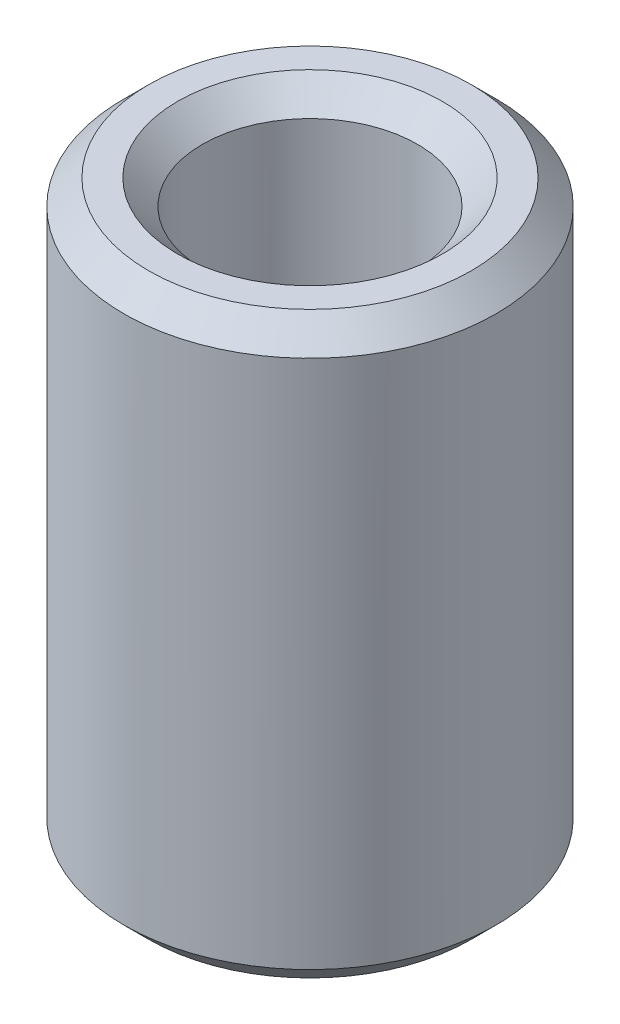
ISO-10303-21;
HEADER;
FILE_DESCRIPTION(('STEP AP214'),'2;1');
FILE_NAME('part.step','',(''),(''),'','','');
FILE_SCHEMA(('AUTOMOTIVE_DESIGN { 1 0 10303 214 1 1 1 1 }'));
ENDSEC;
DATA;
#1=APPLICATION_CONTEXT('core data for automotive mechanical design processes');
#2=APPLICATION_PROTOCOL_DEFINITION('international standard','automotive_design',2000,#1);
#3=PRODUCT_CONTEXT('',#1,'mechanical');
#4=PRODUCT('Part','Part','',(#3));
#5=PRODUCT_RELATED_PRODUCT_CATEGORY('part','',(#4));
#6=PRODUCT_DEFINITION_FORMATION('','',#4);
#7=PRODUCT_DEFINITION_CONTEXT('part definition',#1,'design');
#8=PRODUCT_DEFINITION('design','',#6,#7);
#9=PRODUCT_DEFINITION_SHAPE('','',#8);
#10=(LENGTH_UNIT() NAMED_UNIT(*) SI_UNIT(.MILLI.,.METRE.));
#11=(NAMED_UNIT(*) PLANE_ANGLE_UNIT() SI_UNIT($,.RADIAN.));
#12=(NAMED_UNIT(*) SI_UNIT($,.STERADIAN.) SOLID_ANGLE_UNIT());
#13=UNCERTAINTY_MEASURE_WITH_UNIT(LENGTH_MEASURE(1.E-05),#10,'distance_accuracy_value','');
#14=(GEOMETRIC_REPRESENTATION_CONTEXT(3) GLOBAL_UNCERTAINTY_ASSIGNED_CONTEXT((#13)) GLOBAL_UNIT_ASSIGNED_CONTEXT((#10,
#11,#12)) REPRESENTATION_CONTEXT('',''));
#15=CARTESIAN_POINT('',(0.,0.,0.));
#16=DIRECTION('',(0.,0.,1.));
#17=DIRECTION('',(1.,0.,0.));
#18=AXIS2_PLACEMENT_3D('',#15,#16,#17);
#19=CARTESIAN_POINT('',(0.,0.,0.));
#20=DIRECTION('',(0.,1.,0.));
#21=DIRECTION('',(0.,0.,1.));
#22=AXIS2_PLACEMENT_3D('',#19,#20,#21);
#23=CYLINDRICAL_SURFACE('',#22,1.3);
#24=CARTESIAN_POINT('',(0.,6.70000000002346,0.));
#25=DIRECTION('',(0.,1.,0.));
#26=DIRECTION('',(0.,0.,1.));
#27=AXIS2_PLACEMENT_3D('',#24,#25,#26);
#28=CIRCLE('',#27,1.29999999995789);
#29=CARTESIAN_POINT('',(0.,6.70000000002346,1.29999999995789));
#30=VERTEX_POINT('',#29);
#31=EDGE_CURVE('E33',#30,#30,#28,.T.);
#32=ORIENTED_EDGE('',*,*,#31,.T.);
#33=EDGE_LOOP('',(#32));
#34=FACE_BOUND('',#33,.T.);
#35=CARTESIAN_POINT('',(0.,0.300000000038381,0.));
#36=DIRECTION('',(0.,-1.,0.));
#37=DIRECTION('',(0.,0.,-1.));
#38=AXIS2_PLACEMENT_3D('',#35,#36,#37);
#39=CIRCLE('',#38,1.29999999995789);
#40=CARTESIAN_POINT('',(0.,0.300000000038381,-1.29999999995789));
#41=VERTEX_POINT('',#40);
#42=EDGE_CURVE('E30',#41,#41,#39,.T.);
#43=ORIENTED_EDGE('',*,*,#42,.T.);
#44=EDGE_LOOP('',(#43));
#45=FACE_BOUND('',#44,.T.);
#46=ADVANCED_FACE('F15',(#34,#45),#23,.F.);
#47=CARTESIAN_POINT('',(0.,6.99999999994816,0.));
#48=DIRECTION('',(0.,1.,0.));
#49=DIRECTION('',(-1.,0.,0.));
#50=AXIS2_PLACEMENT_3D('',#47,#48,#49);
#51=CONICAL_SURFACE('',#50,1.59999999993943,0.785398163492187);
#52=ORIENTED_EDGE('',*,*,#31,.F.);
#53=EDGE_LOOP('',(#52));
#54=FACE_BOUND('',#53,.T.);
#55=CARTESIAN_POINT('',(0.,7.000000000005,0.));
#56=DIRECTION('',(0.,1.,0.));
#57=DIRECTION('',(-1.,0.,0.));
#58=AXIS2_PLACEMENT_3D('',#55,#56,#57);
#59=CIRCLE('',#58,1.59999999999627);
#60=CARTESIAN_POINT('',(-1.59999999999627,7.000000000005,0.));
#61=VERTEX_POINT('',#60);
#62=EDGE_CURVE('E18',#61,#61,#59,.F.);
#63=ORIENTED_EDGE('',*,*,#62,.F.);
#64=EDGE_LOOP('',(#63));
#65=FACE_BOUND('',#64,.T.);
#66=ADVANCED_FACE('F49',(#54,#65),#51,.F.);
#67=CARTESIAN_POINT('',(0.,0.,0.));
#68=DIRECTION('',(0.,-1.,0.));
#69=DIRECTION('',(0.,0.,-1.));
#70=AXIS2_PLACEMENT_3D('',#67,#68,#69);
#71=CONICAL_SURFACE('',#70,1.60000000005311,0.785398163397448);
#72=CARTESIAN_POINT('',(0.,0.,0.));
#73=DIRECTION('',(0.,-1.,0.));
#74=DIRECTION('',(0.,0.,-1.));
#75=AXIS2_PLACEMENT_3D('',#72,#73,#74);
#76=CIRCLE('',#75,1.60000000005311);
#77=CARTESIAN_POINT('',(0.,0.,-1.60000000005311));
#78=VERTEX_POINT('',#77);
#79=EDGE_CURVE('E40',#78,#78,#76,.T.);
#80=ORIENTED_EDGE('',*,*,#79,.T.);
#81=EDGE_LOOP('',(#80));
#82=FACE_BOUND('',#81,.T.);
#83=ORIENTED_EDGE('',*,*,#42,.F.);
#84=EDGE_LOOP('',(#83));
#85=FACE_BOUND('',#84,.T.);
#86=ADVANCED_FACE('F51',(#82,#85),#71,.F.);
#87=CARTESIAN_POINT('',(0.,7.,0.));
#88=DIRECTION('',(0.,1.,0.));
#89=DIRECTION('',(0.,0.,1.));
#90=AXIS2_PLACEMENT_3D('',#87,#88,#89);
#91=PLANE('',#90);
#92=CARTESIAN_POINT('',(0.,7.00000000006185,0.));
#93=DIRECTION('',(0.,-1.,0.));
#94=DIRECTION('',(1.,0.,0.));
#95=AXIS2_PLACEMENT_3D('',#92,#93,#94);
#96=CIRCLE('',#95,1.94999999996526);
#97=CARTESIAN_POINT('',(1.94999999996526,7.00000000006185,0.));
#98=VERTEX_POINT('',#97);
#99=EDGE_CURVE('E38',#98,#98,#96,.T.);
#100=ORIENTED_EDGE('',*,*,#99,.F.);
#101=EDGE_LOOP('',(#100));
#102=FACE_BOUND('',#101,.T.);
#103=ORIENTED_EDGE('',*,*,#62,.T.);
#104=EDGE_LOOP('',(#103));
#105=FACE_BOUND('',#104,.T.);
#106=ADVANCED_FACE('F47',(#102,#105),#91,.T.);
#107=CARTESIAN_POINT('',(0.,0.,0.));
#108=DIRECTION('',(0.,1.,0.));
#109=DIRECTION('',(0.,0.,1.));
#110=AXIS2_PLACEMENT_3D('',#107,#108,#109);
#111=PLANE('',#110);
#112=CARTESIAN_POINT('',(0.,0.,0.));
#113=DIRECTION('',(0.,1.,0.));
#114=DIRECTION('',(0.,0.,1.));
#115=AXIS2_PLACEMENT_3D('',#112,#113,#114);
#116=CIRCLE('',#115,1.9500000000221);
#117=CARTESIAN_POINT('',(0.,0.,1.9500000000221));
#118=VERTEX_POINT('',#117);
#119=EDGE_CURVE('E27',#118,#118,#116,.T.);
#120=ORIENTED_EDGE('',*,*,#119,.F.);
#121=EDGE_LOOP('',(#120));
#122=FACE_BOUND('',#121,.T.);
#123=ORIENTED_EDGE('',*,*,#79,.F.);
#124=EDGE_LOOP('',(#123));
#125=FACE_BOUND('',#124,.T.);
#126=ADVANCED_FACE('F75',(#122,#125),#111,.F.);
#127=CARTESIAN_POINT('',(0.,6.70000000002346,0.));
#128=DIRECTION('',(0.,-1.,0.));
#129=DIRECTION('',(1.,0.,0.));
#130=AXIS2_PLACEMENT_3D('',#127,#128,#129);
#131=CONICAL_SURFACE('',#130,2.25000000006048,0.785398163492187);
#132=CARTESIAN_POINT('',(0.,6.7,0.));
#133=DIRECTION('',(0.,-1.,0.));
#134=DIRECTION('',(0.,0.,-1.));
#135=AXIS2_PLACEMENT_3D('',#132,#133,#134);
#136=CIRCLE('',#135,2.25);
#137=CARTESIAN_POINT('',(0.,6.7,-2.25));
#138=VERTEX_POINT('',#137);
#139=EDGE_CURVE('E22',#138,#138,#136,.T.);
#140=ORIENTED_EDGE('',*,*,#139,.F.);
#141=EDGE_LOOP('',(#140));
#142=FACE_BOUND('',#141,.T.);
#143=ORIENTED_EDGE('',*,*,#99,.T.);
#144=EDGE_LOOP('',(#143));
#145=FACE_BOUND('',#144,.T.);
#146=ADVANCED_FACE('F68',(#142,#145),#131,.T.);
#147=CARTESIAN_POINT('',(0.,0.299999999924694,0.));
#148=DIRECTION('',(0.,1.,0.));
#149=DIRECTION('',(0.,0.,1.));
#150=AXIS2_PLACEMENT_3D('',#147,#148,#149);
#151=CONICAL_SURFACE('',#150,2.25000000000364,0.785398163492187);
#152=CARTESIAN_POINT('',(0.,0.300000000000001,0.));
#153=DIRECTION('',(0.,-1.,0.));
#154=DIRECTION('',(0.,0.,-1.));
#155=AXIS2_PLACEMENT_3D('',#152,#153,#154);
#156=CIRCLE('',#155,2.25);
#157=CARTESIAN_POINT('',(0.,0.300000000000001,-2.25));
#158=VERTEX_POINT('',#157);
#159=EDGE_CURVE('E10',#158,#158,#156,.F.);
#160=ORIENTED_EDGE('',*,*,#159,.F.);
#161=EDGE_LOOP('',(#160));
#162=FACE_BOUND('',#161,.T.);
#163=ORIENTED_EDGE('',*,*,#119,.T.);
#164=EDGE_LOOP('',(#163));
#165=FACE_BOUND('',#164,.T.);
#166=ADVANCED_FACE('F63',(#162,#165),#151,.T.);
#167=CARTESIAN_POINT('',(0.,7.,0.));
#168=DIRECTION('',(0.,-1.,0.));
#169=DIRECTION('',(0.,0.,-1.));
#170=AXIS2_PLACEMENT_3D('',#167,#168,#169);
#171=CYLINDRICAL_SURFACE('',#170,2.25);
#172=ORIENTED_EDGE('',*,*,#159,.T.);
#173=EDGE_LOOP('',(#172));
#174=FACE_BOUND('',#173,.T.);
#175=ORIENTED_EDGE('',*,*,#139,.T.);
#176=EDGE_LOOP('',(#175));
#177=FACE_BOUND('',#176,.T.);
#178=ADVANCED_FACE('F61',(#174,#177),#171,.T.);
#179=CLOSED_SHELL('',(#46,#66,#86,#106,#126,#146,#166,#178));
#180=MANIFOLD_SOLID_BREP('B1',#179);
#181=ADVANCED_BREP_SHAPE_REPRESENTATION('',(#18,#180),#14);
#182=SHAPE_DEFINITION_REPRESENTATION(#9,#181);
ENDSEC;
END-ISO-10303-21;
